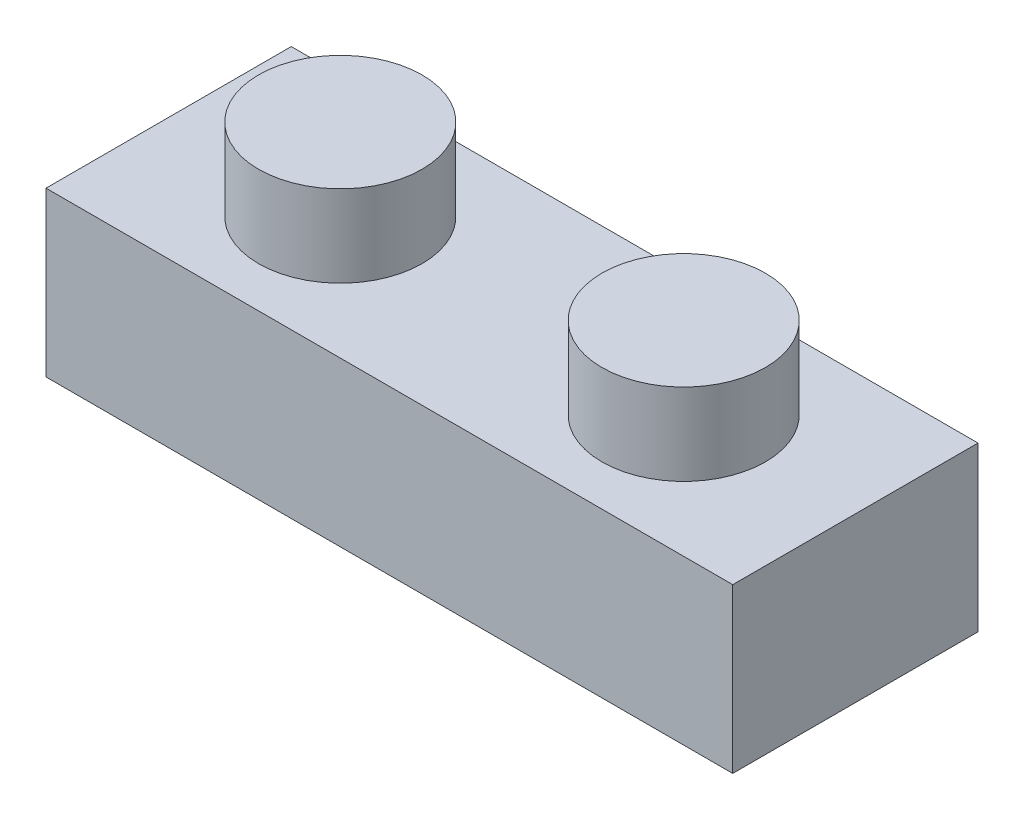
ISO-10303-21;
HEADER;
FILE_DESCRIPTION(('STEP AP214'),'2;1');
FILE_NAME('part.step','',(''),(''),'','','');
FILE_SCHEMA(('AUTOMOTIVE_DESIGN { 1 0 10303 214 1 1 1 1 }'));
ENDSEC;
DATA;
#1=APPLICATION_CONTEXT('core data for automotive mechanical design processes');
#2=APPLICATION_PROTOCOL_DEFINITION('international standard','automotive_design',2000,#1);
#3=PRODUCT_CONTEXT('',#1,'mechanical');
#4=PRODUCT('Part','Part','',(#3));
#5=PRODUCT_RELATED_PRODUCT_CATEGORY('part','',(#4));
#6=PRODUCT_DEFINITION_FORMATION('','',#4);
#7=PRODUCT_DEFINITION_CONTEXT('part definition',#1,'design');
#8=PRODUCT_DEFINITION('design','',#6,#7);
#9=PRODUCT_DEFINITION_SHAPE('','',#8);
#10=(LENGTH_UNIT() NAMED_UNIT(*) SI_UNIT(.MILLI.,.METRE.));
#11=(NAMED_UNIT(*) PLANE_ANGLE_UNIT() SI_UNIT($,.RADIAN.));
#12=(NAMED_UNIT(*) SI_UNIT($,.STERADIAN.) SOLID_ANGLE_UNIT());
#13=UNCERTAINTY_MEASURE_WITH_UNIT(LENGTH_MEASURE(1.E-05),#10,'distance_accuracy_value','');
#14=(GEOMETRIC_REPRESENTATION_CONTEXT(3) GLOBAL_UNCERTAINTY_ASSIGNED_CONTEXT((#13)) GLOBAL_UNIT_ASSIGNED_CONTEXT((#10,
#11,#12)) REPRESENTATION_CONTEXT('',''));
#15=CARTESIAN_POINT('',(0.,0.,0.));
#16=DIRECTION('',(0.,0.,1.));
#17=DIRECTION('',(1.,0.,0.));
#18=AXIS2_PLACEMENT_3D('',#15,#16,#17);
#19=CARTESIAN_POINT('',(0.,10.,15.));
#20=DIRECTION('',(1.,0.,0.));
#21=DIRECTION('',(0.,0.,-1.));
#22=AXIS2_PLACEMENT_3D('',#19,#20,#21);
#23=PLANE('',#22);
#24=DIRECTION('',(0.,0.,1.));
#25=VECTOR('',#24,1.);
#26=CARTESIAN_POINT('',(0.,0.,15.));
#27=LINE('',#26,#25);
#28=CARTESIAN_POINT('',(0.,0.,0.));
#29=VERTEX_POINT('',#28);
#30=CARTESIAN_POINT('',(0.,0.,15.));
#31=VERTEX_POINT('',#30);
#32=EDGE_CURVE('E111',#29,#31,#27,.T.);
#33=ORIENTED_EDGE('',*,*,#32,.T.);
#34=DIRECTION('',(0.,-1.,0.));
#35=VECTOR('',#34,1.);
#36=CARTESIAN_POINT('',(0.,10.,15.));
#37=LINE('',#36,#35);
#38=CARTESIAN_POINT('',(0.,10.,15.));
#39=VERTEX_POINT('',#38);
#40=EDGE_CURVE('E100',#39,#31,#37,.T.);
#41=ORIENTED_EDGE('',*,*,#40,.F.);
#42=DIRECTION('',(0.,0.,1.));
#43=VECTOR('',#42,1.);
#44=CARTESIAN_POINT('',(0.,10.,15.));
#45=LINE('',#44,#43);
#46=CARTESIAN_POINT('',(0.,10.,0.));
#47=VERTEX_POINT('',#46);
#48=EDGE_CURVE('E92',#47,#39,#45,.T.);
#49=ORIENTED_EDGE('',*,*,#48,.F.);
#50=DIRECTION('',(0.,-1.,0.));
#51=VECTOR('',#50,1.);
#52=CARTESIAN_POINT('',(0.,10.,0.));
#53=LINE('',#52,#51);
#54=EDGE_CURVE('E107',#47,#29,#53,.T.);
#55=ORIENTED_EDGE('',*,*,#54,.T.);
#56=EDGE_LOOP('',(#33,#41,#49,#55));
#57=FACE_BOUND('',#56,.T.);
#58=ADVANCED_FACE('F39',(#57),#23,.F.);
#59=CARTESIAN_POINT('',(42.,10.,15.));
#60=DIRECTION('',(0.,0.,-1.));
#61=DIRECTION('',(-1.,0.,0.));
#62=AXIS2_PLACEMENT_3D('',#59,#60,#61);
#63=PLANE('',#62);
#64=DIRECTION('',(1.,0.,0.));
#65=VECTOR('',#64,1.);
#66=CARTESIAN_POINT('',(42.,0.,15.));
#67=LINE('',#66,#65);
#68=CARTESIAN_POINT('',(42.,0.,15.));
#69=VERTEX_POINT('',#68);
#70=EDGE_CURVE('E98',#31,#69,#67,.T.);
#71=ORIENTED_EDGE('',*,*,#70,.T.);
#72=DIRECTION('',(0.,-1.,0.));
#73=VECTOR('',#72,1.);
#74=CARTESIAN_POINT('',(42.,10.,15.));
#75=LINE('',#74,#73);
#76=CARTESIAN_POINT('',(42.,10.,15.));
#77=VERTEX_POINT('',#76);
#78=EDGE_CURVE('E96',#77,#69,#75,.T.);
#79=ORIENTED_EDGE('',*,*,#78,.F.);
#80=DIRECTION('',(1.,0.,0.));
#81=VECTOR('',#80,1.);
#82=CARTESIAN_POINT('',(42.,10.,15.));
#83=LINE('',#82,#81);
#84=EDGE_CURVE('E87',#39,#77,#83,.T.);
#85=ORIENTED_EDGE('',*,*,#84,.F.);
#86=ORIENTED_EDGE('',*,*,#40,.T.);
#87=EDGE_LOOP('',(#71,#79,#85,#86));
#88=FACE_BOUND('',#87,.T.);
#89=ADVANCED_FACE('F97',(#88),#63,.F.);
#90=CARTESIAN_POINT('',(42.,10.,0.));
#91=DIRECTION('',(-1.,0.,0.));
#92=DIRECTION('',(0.,0.,1.));
#93=AXIS2_PLACEMENT_3D('',#90,#91,#92);
#94=PLANE('',#93);
#95=DIRECTION('',(0.,0.,-1.));
#96=VECTOR('',#95,1.);
#97=CARTESIAN_POINT('',(42.,0.,0.));
#98=LINE('',#97,#96);
#99=CARTESIAN_POINT('',(42.,0.,0.));
#100=VERTEX_POINT('',#99);
#101=EDGE_CURVE('E73',#69,#100,#98,.T.);
#102=ORIENTED_EDGE('',*,*,#101,.T.);
#103=DIRECTION('',(0.,-1.,0.));
#104=VECTOR('',#103,1.);
#105=CARTESIAN_POINT('',(42.,10.,0.));
#106=LINE('',#105,#104);
#107=CARTESIAN_POINT('',(42.,10.,0.));
#108=VERTEX_POINT('',#107);
#109=EDGE_CURVE('E101',#108,#100,#106,.T.);
#110=ORIENTED_EDGE('',*,*,#109,.F.);
#111=DIRECTION('',(0.,0.,-1.));
#112=VECTOR('',#111,1.);
#113=CARTESIAN_POINT('',(42.,10.,0.));
#114=LINE('',#113,#112);
#115=EDGE_CURVE('E90',#77,#108,#114,.T.);
#116=ORIENTED_EDGE('',*,*,#115,.F.);
#117=ORIENTED_EDGE('',*,*,#78,.T.);
#118=EDGE_LOOP('',(#102,#110,#116,#117));
#119=FACE_BOUND('',#118,.T.);
#120=ADVANCED_FACE('F103',(#119),#94,.F.);
#121=CARTESIAN_POINT('',(0.,10.,0.));
#122=DIRECTION('',(0.,0.,1.));
#123=DIRECTION('',(1.,0.,0.));
#124=AXIS2_PLACEMENT_3D('',#121,#122,#123);
#125=PLANE('',#124);
#126=DIRECTION('',(-1.,0.,0.));
#127=VECTOR('',#126,1.);
#128=CARTESIAN_POINT('',(0.,0.,0.));
#129=LINE('',#128,#127);
#130=EDGE_CURVE('E79',#100,#29,#129,.T.);
#131=ORIENTED_EDGE('',*,*,#130,.T.);
#132=ORIENTED_EDGE('',*,*,#54,.F.);
#133=DIRECTION('',(-1.,0.,0.));
#134=VECTOR('',#133,1.);
#135=CARTESIAN_POINT('',(0.,10.,0.));
#136=LINE('',#135,#134);
#137=EDGE_CURVE('E56',#108,#47,#136,.T.);
#138=ORIENTED_EDGE('',*,*,#137,.F.);
#139=ORIENTED_EDGE('',*,*,#109,.T.);
#140=EDGE_LOOP('',(#131,#132,#138,#139));
#141=FACE_BOUND('',#140,.T.);
#142=ADVANCED_FACE('F135',(#141),#125,.F.);
#143=CARTESIAN_POINT('',(0.,10.,0.));
#144=DIRECTION('',(0.,-1.,0.));
#145=DIRECTION('',(0.,0.,-1.));
#146=AXIS2_PLACEMENT_3D('',#143,#144,#145);
#147=PLANE('',#146);
#148=CARTESIAN_POINT('',(10.5,10.,7.5));
#149=DIRECTION('',(0.,-1.,0.));
#150=DIRECTION('',(0.,0.,-1.));
#151=AXIS2_PLACEMENT_3D('',#148,#149,#150);
#152=CIRCLE('',#151,5.);
#153=CARTESIAN_POINT('',(10.5,10.,2.5));
#154=VERTEX_POINT('',#153);
#155=EDGE_CURVE('E11',#154,#154,#152,.F.);
#156=ORIENTED_EDGE('',*,*,#155,.F.);
#157=EDGE_LOOP('',(#156));
#158=FACE_BOUND('',#157,.T.);
#159=CARTESIAN_POINT('',(31.5,10.,7.5));
#160=DIRECTION('',(0.,-1.,0.));
#161=DIRECTION('',(0.,0.,-1.));
#162=AXIS2_PLACEMENT_3D('',#159,#160,#161);
#163=CIRCLE('',#162,5.);
#164=CARTESIAN_POINT('',(31.5,10.,2.5));
#165=VERTEX_POINT('',#164);
#166=EDGE_CURVE('E48',#165,#165,#163,.F.);
#167=ORIENTED_EDGE('',*,*,#166,.F.);
#168=EDGE_LOOP('',(#167));
#169=FACE_BOUND('',#168,.T.);
#170=ORIENTED_EDGE('',*,*,#48,.T.);
#171=ORIENTED_EDGE('',*,*,#84,.T.);
#172=ORIENTED_EDGE('',*,*,#115,.T.);
#173=ORIENTED_EDGE('',*,*,#137,.T.);
#174=EDGE_LOOP('',(#170,#171,#172,#173));
#175=FACE_BOUND('',#174,.T.);
#176=ADVANCED_FACE('F88',(#158,#169,#175),#147,.F.);
#177=CARTESIAN_POINT('',(0.,0.,0.));
#178=DIRECTION('',(0.,-1.,0.));
#179=DIRECTION('',(0.,0.,-1.));
#180=AXIS2_PLACEMENT_3D('',#177,#178,#179);
#181=PLANE('',#180);
#182=ORIENTED_EDGE('',*,*,#32,.F.);
#183=ORIENTED_EDGE('',*,*,#130,.F.);
#184=ORIENTED_EDGE('',*,*,#101,.F.);
#185=ORIENTED_EDGE('',*,*,#70,.F.);
#186=EDGE_LOOP('',(#182,#183,#184,#185));
#187=FACE_BOUND('',#186,.T.);
#188=ADVANCED_FACE('F134',(#187),#181,.T.);
#189=CARTESIAN_POINT('',(31.5,15.,7.5));
#190=DIRECTION('',(0.,-1.,0.));
#191=DIRECTION('',(0.,0.,-1.));
#192=AXIS2_PLACEMENT_3D('',#189,#190,#191);
#193=CYLINDRICAL_SURFACE('',#192,5.);
#194=CARTESIAN_POINT('',(31.5,15.,7.5));
#195=DIRECTION('',(0.,1.,0.));
#196=DIRECTION('',(0.,0.,1.));
#197=AXIS2_PLACEMENT_3D('',#194,#195,#196);
#198=CIRCLE('',#197,5.);
#199=CARTESIAN_POINT('',(31.5,15.,12.5));
#200=VERTEX_POINT('',#199);
#201=EDGE_CURVE('E115',#200,#200,#198,.T.);
#202=ORIENTED_EDGE('',*,*,#201,.F.);
#203=EDGE_LOOP('',(#202));
#204=FACE_BOUND('',#203,.T.);
#205=ORIENTED_EDGE('',*,*,#166,.T.);
#206=EDGE_LOOP('',(#205));
#207=FACE_BOUND('',#206,.T.);
#208=ADVANCED_FACE('F131',(#204,#207),#193,.T.);
#209=CARTESIAN_POINT('',(31.5,15.,7.5));
#210=DIRECTION('',(0.,1.,0.));
#211=DIRECTION('',(0.,0.,1.));
#212=AXIS2_PLACEMENT_3D('',#209,#210,#211);
#213=PLANE('',#212);
#214=ORIENTED_EDGE('',*,*,#201,.T.);
#215=EDGE_LOOP('',(#214));
#216=FACE_BOUND('',#215,.T.);
#217=ADVANCED_FACE('F168',(#216),#213,.T.);
#218=CARTESIAN_POINT('',(10.5,15.,7.5));
#219=DIRECTION('',(0.,-1.,0.));
#220=DIRECTION('',(0.,0.,-1.));
#221=AXIS2_PLACEMENT_3D('',#218,#219,#220);
#222=CYLINDRICAL_SURFACE('',#221,5.);
#223=CARTESIAN_POINT('',(10.5,15.,7.5));
#224=DIRECTION('',(0.,1.,0.));
#225=DIRECTION('',(0.,0.,-1.));
#226=AXIS2_PLACEMENT_3D('',#223,#224,#225);
#227=CIRCLE('',#226,5.);
#228=CARTESIAN_POINT('',(10.5,15.,2.5));
#229=VERTEX_POINT('',#228);
#230=EDGE_CURVE('E158',#229,#229,#227,.T.);
#231=ORIENTED_EDGE('',*,*,#230,.F.);
#232=EDGE_LOOP('',(#231));
#233=FACE_BOUND('',#232,.T.);
#234=ORIENTED_EDGE('',*,*,#155,.T.);
#235=EDGE_LOOP('',(#234));
#236=FACE_BOUND('',#235,.T.);
#237=ADVANCED_FACE('F165',(#233,#236),#222,.T.);
#238=CARTESIAN_POINT('',(10.5,15.,7.5));
#239=DIRECTION('',(0.,-1.,0.));
#240=DIRECTION('',(0.,0.,-1.));
#241=AXIS2_PLACEMENT_3D('',#238,#239,#240);
#242=PLANE('',#241);
#243=ORIENTED_EDGE('',*,*,#230,.T.);
#244=EDGE_LOOP('',(#243));
#245=FACE_BOUND('',#244,.T.);
#246=ADVANCED_FACE('F163',(#245),#242,.F.);
#247=CLOSED_SHELL('',(#58,#89,#120,#142,#176,#188,#208,#217,#237,#246));
#248=MANIFOLD_SOLID_BREP('B2',#247);
#249=ADVANCED_BREP_SHAPE_REPRESENTATION('',(#18,#248),#14);
#250=SHAPE_DEFINITION_REPRESENTATION(#9,#249);
ENDSEC;
END-ISO-10303-21;
